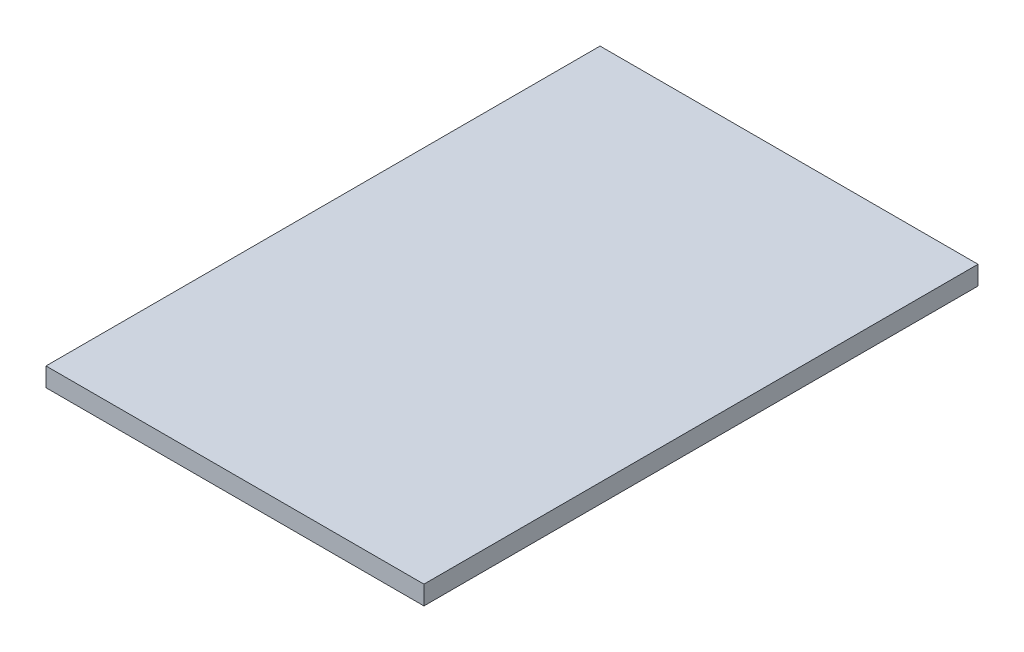
ISO-10303-21;
HEADER;
FILE_DESCRIPTION(('STEP AP214'),'2;1');
FILE_NAME('part.step','',(''),(''),'','','');
FILE_SCHEMA(('AUTOMOTIVE_DESIGN { 1 0 10303 214 1 1 1 1 }'));
ENDSEC;
DATA;
#1=APPLICATION_CONTEXT('core data for automotive mechanical design processes');
#2=APPLICATION_PROTOCOL_DEFINITION('international standard','automotive_design',2000,#1);
#3=PRODUCT_CONTEXT('',#1,'mechanical');
#4=PRODUCT('Part','Part','',(#3));
#5=PRODUCT_RELATED_PRODUCT_CATEGORY('part','',(#4));
#6=PRODUCT_DEFINITION_FORMATION('','',#4);
#7=PRODUCT_DEFINITION_CONTEXT('part definition',#1,'design');
#8=PRODUCT_DEFINITION('design','',#6,#7);
#9=PRODUCT_DEFINITION_SHAPE('','',#8);
#10=(LENGTH_UNIT() NAMED_UNIT(*) SI_UNIT(.MILLI.,.METRE.));
#11=(NAMED_UNIT(*) PLANE_ANGLE_UNIT() SI_UNIT($,.RADIAN.));
#12=(NAMED_UNIT(*) SI_UNIT($,.STERADIAN.) SOLID_ANGLE_UNIT());
#13=UNCERTAINTY_MEASURE_WITH_UNIT(LENGTH_MEASURE(1.E-05),#10,'distance_accuracy_value','');
#14=(GEOMETRIC_REPRESENTATION_CONTEXT(3) GLOBAL_UNCERTAINTY_ASSIGNED_CONTEXT((#13)) GLOBAL_UNIT_ASSIGNED_CONTEXT((#10,
#11,#12)) REPRESENTATION_CONTEXT('',''));
#15=CARTESIAN_POINT('',(0.,0.,0.));
#16=DIRECTION('',(0.,0.,1.));
#17=DIRECTION('',(1.,0.,0.));
#18=AXIS2_PLACEMENT_3D('',#15,#16,#17);
#19=CARTESIAN_POINT('',(63.5,6.35,-93.091));
#20=DIRECTION('',(-1.,0.,0.));
#21=DIRECTION('',(0.,0.,1.));
#22=AXIS2_PLACEMENT_3D('',#19,#20,#21);
#23=PLANE('',#22);
#24=DIRECTION('',(0.,0.,-1.));
#25=VECTOR('',#24,1.);
#26=CARTESIAN_POINT('',(63.5,0.,-93.091));
#27=LINE('',#26,#25);
#28=CARTESIAN_POINT('',(63.5,0.,93.091));
#29=VERTEX_POINT('',#28);
#30=CARTESIAN_POINT('',(63.5,0.,-93.091));
#31=VERTEX_POINT('',#30);
#32=EDGE_CURVE('E96',#29,#31,#27,.T.);
#33=ORIENTED_EDGE('',*,*,#32,.T.);
#34=DIRECTION('',(0.,-1.,0.));
#35=VECTOR('',#34,1.);
#36=CARTESIAN_POINT('',(63.5,6.35,-93.091));
#37=LINE('',#36,#35);
#38=CARTESIAN_POINT('',(63.5,6.35,-93.091));
#39=VERTEX_POINT('',#38);
#40=EDGE_CURVE('E11',#39,#31,#37,.T.);
#41=ORIENTED_EDGE('',*,*,#40,.F.);
#42=DIRECTION('',(0.,0.,-1.));
#43=VECTOR('',#42,1.);
#44=CARTESIAN_POINT('',(63.5,6.35,-93.091));
#45=LINE('',#44,#43);
#46=CARTESIAN_POINT('',(63.5,6.35,93.091));
#47=VERTEX_POINT('',#46);
#48=EDGE_CURVE('E84',#47,#39,#45,.T.);
#49=ORIENTED_EDGE('',*,*,#48,.F.);
#50=DIRECTION('',(0.,-1.,0.));
#51=VECTOR('',#50,1.);
#52=CARTESIAN_POINT('',(63.5,6.35,93.091));
#53=LINE('',#52,#51);
#54=EDGE_CURVE('E92',#47,#29,#53,.T.);
#55=ORIENTED_EDGE('',*,*,#54,.T.);
#56=EDGE_LOOP('',(#33,#41,#49,#55));
#57=FACE_BOUND('',#56,.T.);
#58=ADVANCED_FACE('F33',(#57),#23,.F.);
#59=CARTESIAN_POINT('',(-63.5,6.35,-93.091));
#60=DIRECTION('',(0.,0.,1.));
#61=DIRECTION('',(1.,0.,0.));
#62=AXIS2_PLACEMENT_3D('',#59,#60,#61);
#63=PLANE('',#62);
#64=DIRECTION('',(-1.,0.,0.));
#65=VECTOR('',#64,1.);
#66=CARTESIAN_POINT('',(-63.5,0.,-93.091));
#67=LINE('',#66,#65);
#68=CARTESIAN_POINT('',(-63.5,0.,-93.091));
#69=VERTEX_POINT('',#68);
#70=EDGE_CURVE('E88',#31,#69,#67,.T.);
#71=ORIENTED_EDGE('',*,*,#70,.T.);
#72=DIRECTION('',(0.,-1.,0.));
#73=VECTOR('',#72,1.);
#74=CARTESIAN_POINT('',(-63.5,6.35,-93.091));
#75=LINE('',#74,#73);
#76=CARTESIAN_POINT('',(-63.5,6.35,-93.091));
#77=VERTEX_POINT('',#76);
#78=EDGE_CURVE('E41',#77,#69,#75,.T.);
#79=ORIENTED_EDGE('',*,*,#78,.F.);
#80=DIRECTION('',(-1.,0.,0.));
#81=VECTOR('',#80,1.);
#82=CARTESIAN_POINT('',(-63.5,6.35,-93.091));
#83=LINE('',#82,#81);
#84=EDGE_CURVE('E79',#39,#77,#83,.T.);
#85=ORIENTED_EDGE('',*,*,#84,.F.);
#86=ORIENTED_EDGE('',*,*,#40,.T.);
#87=EDGE_LOOP('',(#71,#79,#85,#86));
#88=FACE_BOUND('',#87,.T.);
#89=ADVANCED_FACE('F87',(#88),#63,.F.);
#90=CARTESIAN_POINT('',(-63.5,6.35,-93.091));
#91=DIRECTION('',(1.,0.,0.));
#92=DIRECTION('',(0.,0.,-1.));
#93=AXIS2_PLACEMENT_3D('',#90,#91,#92);
#94=PLANE('',#93);
#95=DIRECTION('',(0.,0.,1.));
#96=VECTOR('',#95,1.);
#97=CARTESIAN_POINT('',(-63.5,0.,-93.091));
#98=LINE('',#97,#96);
#99=CARTESIAN_POINT('',(-63.5,0.,93.091));
#100=VERTEX_POINT('',#99);
#101=EDGE_CURVE('E66',#69,#100,#98,.T.);
#102=ORIENTED_EDGE('',*,*,#101,.T.);
#103=DIRECTION('',(0.,-1.,0.));
#104=VECTOR('',#103,1.);
#105=CARTESIAN_POINT('',(-63.5,6.35,93.091));
#106=LINE('',#105,#104);
#107=CARTESIAN_POINT('',(-63.5,6.35,93.091));
#108=VERTEX_POINT('',#107);
#109=EDGE_CURVE('E89',#108,#100,#106,.T.);
#110=ORIENTED_EDGE('',*,*,#109,.F.);
#111=DIRECTION('',(0.,0.,1.));
#112=VECTOR('',#111,1.);
#113=CARTESIAN_POINT('',(-63.5,6.35,-93.091));
#114=LINE('',#113,#112);
#115=EDGE_CURVE('E82',#77,#108,#114,.T.);
#116=ORIENTED_EDGE('',*,*,#115,.F.);
#117=ORIENTED_EDGE('',*,*,#78,.T.);
#118=EDGE_LOOP('',(#102,#110,#116,#117));
#119=FACE_BOUND('',#118,.T.);
#120=ADVANCED_FACE('F90',(#119),#94,.F.);
#121=CARTESIAN_POINT('',(-63.5,6.35,93.091));
#122=DIRECTION('',(0.,0.,-1.));
#123=DIRECTION('',(-1.,0.,0.));
#124=AXIS2_PLACEMENT_3D('',#121,#122,#123);
#125=PLANE('',#124);
#126=DIRECTION('',(1.,0.,0.));
#127=VECTOR('',#126,1.);
#128=CARTESIAN_POINT('',(-63.5,0.,93.091));
#129=LINE('',#128,#127);
#130=EDGE_CURVE('E72',#100,#29,#129,.T.);
#131=ORIENTED_EDGE('',*,*,#130,.T.);
#132=ORIENTED_EDGE('',*,*,#54,.F.);
#133=DIRECTION('',(1.,0.,0.));
#134=VECTOR('',#133,1.);
#135=CARTESIAN_POINT('',(-63.5,6.35,93.091));
#136=LINE('',#135,#134);
#137=EDGE_CURVE('E49',#108,#47,#136,.T.);
#138=ORIENTED_EDGE('',*,*,#137,.F.);
#139=ORIENTED_EDGE('',*,*,#109,.T.);
#140=EDGE_LOOP('',(#131,#132,#138,#139));
#141=FACE_BOUND('',#140,.T.);
#142=ADVANCED_FACE('F103',(#141),#125,.F.);
#143=CARTESIAN_POINT('',(0.,6.35,0.));
#144=DIRECTION('',(0.,1.,0.));
#145=DIRECTION('',(0.,0.,1.));
#146=AXIS2_PLACEMENT_3D('',#143,#144,#145);
#147=PLANE('',#146);
#148=ORIENTED_EDGE('',*,*,#48,.T.);
#149=ORIENTED_EDGE('',*,*,#84,.T.);
#150=ORIENTED_EDGE('',*,*,#115,.T.);
#151=ORIENTED_EDGE('',*,*,#137,.T.);
#152=EDGE_LOOP('',(#148,#149,#150,#151));
#153=FACE_BOUND('',#152,.T.);
#154=ADVANCED_FACE('F80',(#153),#147,.T.);
#155=CARTESIAN_POINT('',(0.,0.,0.));
#156=DIRECTION('',(0.,1.,0.));
#157=DIRECTION('',(0.,0.,1.));
#158=AXIS2_PLACEMENT_3D('',#155,#156,#157);
#159=PLANE('',#158);
#160=ORIENTED_EDGE('',*,*,#32,.F.);
#161=ORIENTED_EDGE('',*,*,#130,.F.);
#162=ORIENTED_EDGE('',*,*,#101,.F.);
#163=ORIENTED_EDGE('',*,*,#70,.F.);
#164=EDGE_LOOP('',(#160,#161,#162,#163));
#165=FACE_BOUND('',#164,.T.);
#166=ADVANCED_FACE('F106',(#165),#159,.F.);
#167=CLOSED_SHELL('',(#58,#89,#120,#142,#154,#166));
#168=MANIFOLD_SOLID_BREP('B2',#167);
#169=ADVANCED_BREP_SHAPE_REPRESENTATION('',(#18,#168),#14);
#170=SHAPE_DEFINITION_REPRESENTATION(#9,#169);
ENDSEC;
END-ISO-10303-21;
